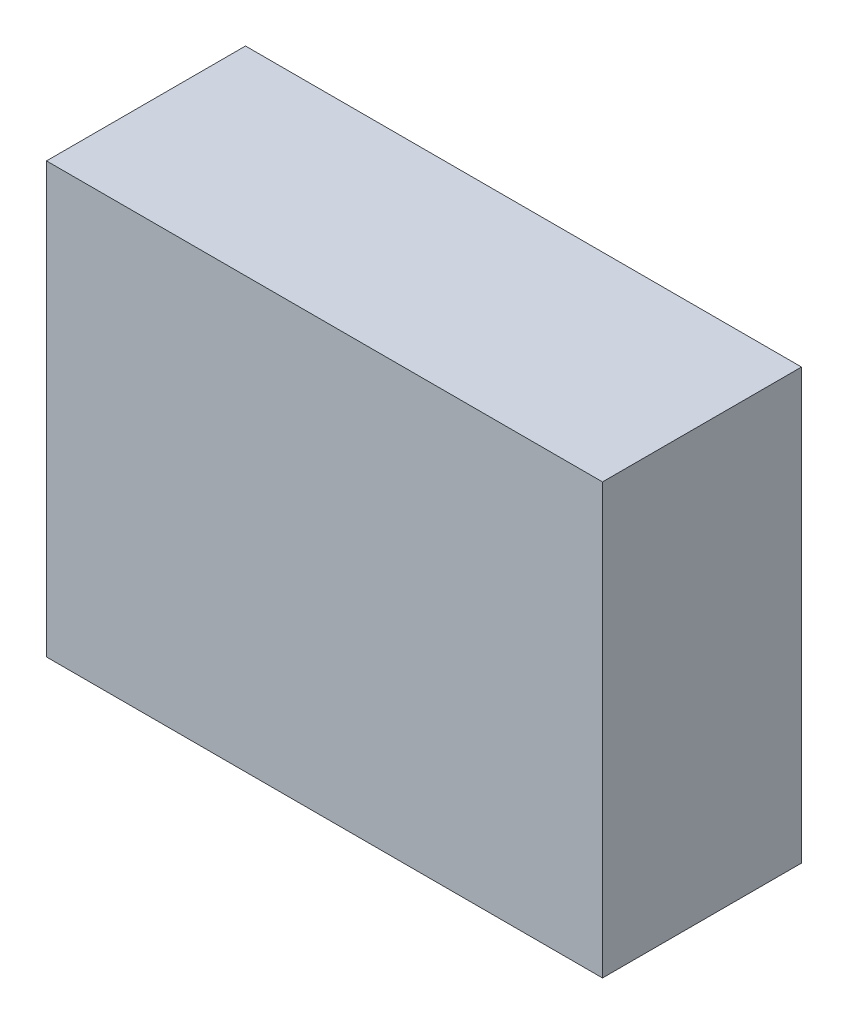
ISO-10303-21;
HEADER;
FILE_DESCRIPTION(('STEP AP214'),'2;1');
FILE_NAME('part.step','',(''),(''),'','','');
FILE_SCHEMA(('AUTOMOTIVE_DESIGN { 1 0 10303 214 1 1 1 1 }'));
ENDSEC;
DATA;
#1=APPLICATION_CONTEXT('core data for automotive mechanical design processes');
#2=APPLICATION_PROTOCOL_DEFINITION('international standard','automotive_design',2000,#1);
#3=PRODUCT_CONTEXT('',#1,'mechanical');
#4=PRODUCT('Part','Part','',(#3));
#5=PRODUCT_RELATED_PRODUCT_CATEGORY('part','',(#4));
#6=PRODUCT_DEFINITION_FORMATION('','',#4);
#7=PRODUCT_DEFINITION_CONTEXT('part definition',#1,'design');
#8=PRODUCT_DEFINITION('design','',#6,#7);
#9=PRODUCT_DEFINITION_SHAPE('','',#8);
#10=(LENGTH_UNIT() NAMED_UNIT(*) SI_UNIT(.MILLI.,.METRE.));
#11=(NAMED_UNIT(*) PLANE_ANGLE_UNIT() SI_UNIT($,.RADIAN.));
#12=(NAMED_UNIT(*) SI_UNIT($,.STERADIAN.) SOLID_ANGLE_UNIT());
#13=UNCERTAINTY_MEASURE_WITH_UNIT(LENGTH_MEASURE(1.E-05),#10,'distance_accuracy_value','');
#14=(GEOMETRIC_REPRESENTATION_CONTEXT(3) GLOBAL_UNCERTAINTY_ASSIGNED_CONTEXT((#13)) GLOBAL_UNIT_ASSIGNED_CONTEXT((#10,
#11,#12)) REPRESENTATION_CONTEXT('',''));
#15=CARTESIAN_POINT('',(0.,0.,0.));
#16=DIRECTION('',(0.,0.,1.));
#17=DIRECTION('',(1.,0.,0.));
#18=AXIS2_PLACEMENT_3D('',#15,#16,#17);
#19=CARTESIAN_POINT('',(0.,0.,0.1999996));
#20=DIRECTION('',(0.,0.,1.));
#21=DIRECTION('',(1.,0.,0.));
#22=AXIS2_PLACEMENT_3D('',#19,#20,#21);
#23=PLANE('',#22);
#24=DIRECTION('',(0.,1.,0.));
#25=VECTOR('',#24,1.);
#26=CARTESIAN_POINT('',(0.2794,-0.2159,0.1999996));
#27=LINE('',#26,#25);
#28=CARTESIAN_POINT('',(0.2794,-0.2159,0.1999996));
#29=VERTEX_POINT('',#28);
#30=CARTESIAN_POINT('',(0.2794,0.2159,0.1999996));
#31=VERTEX_POINT('',#30);
#32=EDGE_CURVE('E92',#29,#31,#27,.T.);
#33=ORIENTED_EDGE('',*,*,#32,.T.);
#34=DIRECTION('',(-1.,0.,0.));
#35=VECTOR('',#34,1.);
#36=CARTESIAN_POINT('',(0.2794,0.2159,0.1999996));
#37=LINE('',#36,#35);
#38=CARTESIAN_POINT('',(-0.2794,0.2159,0.1999996));
#39=VERTEX_POINT('',#38);
#40=EDGE_CURVE('E75',#31,#39,#37,.T.);
#41=ORIENTED_EDGE('',*,*,#40,.T.);
#42=DIRECTION('',(0.,-1.,0.));
#43=VECTOR('',#42,1.);
#44=CARTESIAN_POINT('',(-0.2794,0.2159,0.1999996));
#45=LINE('',#44,#43);
#46=CARTESIAN_POINT('',(-0.2794,-0.2159,0.1999996));
#47=VERTEX_POINT('',#46);
#48=EDGE_CURVE('E86',#39,#47,#45,.T.);
#49=ORIENTED_EDGE('',*,*,#48,.T.);
#50=DIRECTION('',(1.,0.,0.));
#51=VECTOR('',#50,1.);
#52=CARTESIAN_POINT('',(-0.2794,-0.2159,0.1999996));
#53=LINE('',#52,#51);
#54=EDGE_CURVE('E11',#47,#29,#53,.T.);
#55=ORIENTED_EDGE('',*,*,#54,.T.);
#56=EDGE_LOOP('',(#33,#41,#49,#55));
#57=FACE_BOUND('',#56,.T.);
#58=ADVANCED_FACE('F17',(#57),#23,.T.);
#59=CARTESIAN_POINT('',(0.,0.,0.));
#60=DIRECTION('',(0.,0.,1.));
#61=DIRECTION('',(1.,0.,0.));
#62=AXIS2_PLACEMENT_3D('',#59,#60,#61);
#63=PLANE('',#62);
#64=DIRECTION('',(1.,0.,0.));
#65=VECTOR('',#64,1.);
#66=CARTESIAN_POINT('',(-0.2794,-0.2159,0.));
#67=LINE('',#66,#65);
#68=CARTESIAN_POINT('',(-0.2794,-0.2159,0.));
#69=VERTEX_POINT('',#68);
#70=CARTESIAN_POINT('',(0.2794,-0.2159,0.));
#71=VERTEX_POINT('',#70);
#72=EDGE_CURVE('E20',#69,#71,#67,.T.);
#73=ORIENTED_EDGE('',*,*,#72,.F.);
#74=DIRECTION('',(0.,-1.,0.));
#75=VECTOR('',#74,1.);
#76=CARTESIAN_POINT('',(-0.2794,0.2159,0.));
#77=LINE('',#76,#75);
#78=CARTESIAN_POINT('',(-0.2794,0.2159,0.));
#79=VERTEX_POINT('',#78);
#80=EDGE_CURVE('E58',#79,#69,#77,.T.);
#81=ORIENTED_EDGE('',*,*,#80,.F.);
#82=DIRECTION('',(-1.,0.,0.));
#83=VECTOR('',#82,1.);
#84=CARTESIAN_POINT('',(0.2794,0.2159,0.));
#85=LINE('',#84,#83);
#86=CARTESIAN_POINT('',(0.2794,0.2159,0.));
#87=VERTEX_POINT('',#86);
#88=EDGE_CURVE('E94',#87,#79,#85,.T.);
#89=ORIENTED_EDGE('',*,*,#88,.F.);
#90=DIRECTION('',(0.,1.,0.));
#91=VECTOR('',#90,1.);
#92=CARTESIAN_POINT('',(0.2794,-0.2159,0.));
#93=LINE('',#92,#91);
#94=EDGE_CURVE('E91',#71,#87,#93,.T.);
#95=ORIENTED_EDGE('',*,*,#94,.F.);
#96=EDGE_LOOP('',(#73,#81,#89,#95));
#97=FACE_BOUND('',#96,.T.);
#98=ADVANCED_FACE('F96',(#97),#63,.F.);
#99=CARTESIAN_POINT('',(-0.2794,-0.2159,0.));
#100=DIRECTION('',(0.,1.,0.));
#101=DIRECTION('',(1.,0.,0.));
#102=AXIS2_PLACEMENT_3D('',#99,#100,#101);
#103=PLANE('',#102);
#104=ORIENTED_EDGE('',*,*,#72,.T.);
#105=DIRECTION('',(0.,0.,1.));
#106=VECTOR('',#105,1.);
#107=CARTESIAN_POINT('',(0.2794,-0.2159,0.));
#108=LINE('',#107,#106);
#109=EDGE_CURVE('E81',#71,#29,#108,.T.);
#110=ORIENTED_EDGE('',*,*,#109,.T.);
#111=ORIENTED_EDGE('',*,*,#54,.F.);
#112=DIRECTION('',(0.,0.,1.));
#113=VECTOR('',#112,1.);
#114=CARTESIAN_POINT('',(-0.2794,-0.2159,0.));
#115=LINE('',#114,#113);
#116=EDGE_CURVE('E84',#69,#47,#115,.T.);
#117=ORIENTED_EDGE('',*,*,#116,.F.);
#118=EDGE_LOOP('',(#104,#110,#111,#117));
#119=FACE_BOUND('',#118,.T.);
#120=ADVANCED_FACE('F80',(#119),#103,.F.);
#121=CARTESIAN_POINT('',(-0.2794,0.2159,0.));
#122=DIRECTION('',(1.,0.,0.));
#123=DIRECTION('',(0.,1.,0.));
#124=AXIS2_PLACEMENT_3D('',#121,#122,#123);
#125=PLANE('',#124);
#126=ORIENTED_EDGE('',*,*,#80,.T.);
#127=ORIENTED_EDGE('',*,*,#116,.T.);
#128=ORIENTED_EDGE('',*,*,#48,.F.);
#129=DIRECTION('',(0.,0.,1.));
#130=VECTOR('',#129,1.);
#131=CARTESIAN_POINT('',(-0.2794,0.2159,0.));
#132=LINE('',#131,#130);
#133=EDGE_CURVE('E110',#79,#39,#132,.T.);
#134=ORIENTED_EDGE('',*,*,#133,.F.);
#135=EDGE_LOOP('',(#126,#127,#128,#134));
#136=FACE_BOUND('',#135,.T.);
#137=ADVANCED_FACE('F122',(#136),#125,.F.);
#138=CARTESIAN_POINT('',(0.2794,0.2159,0.));
#139=DIRECTION('',(0.,-1.,0.));
#140=DIRECTION('',(0.,0.,-1.));
#141=AXIS2_PLACEMENT_3D('',#138,#139,#140);
#142=PLANE('',#141);
#143=ORIENTED_EDGE('',*,*,#88,.T.);
#144=ORIENTED_EDGE('',*,*,#133,.T.);
#145=ORIENTED_EDGE('',*,*,#40,.F.);
#146=DIRECTION('',(0.,0.,1.));
#147=VECTOR('',#146,1.);
#148=CARTESIAN_POINT('',(0.2794,0.2159,0.));
#149=LINE('',#148,#147);
#150=EDGE_CURVE('E99',#87,#31,#149,.T.);
#151=ORIENTED_EDGE('',*,*,#150,.F.);
#152=EDGE_LOOP('',(#143,#144,#145,#151));
#153=FACE_BOUND('',#152,.T.);
#154=ADVANCED_FACE('F166',(#153),#142,.F.);
#155=CARTESIAN_POINT('',(0.2794,-0.2159,0.));
#156=DIRECTION('',(-1.,0.,0.));
#157=DIRECTION('',(0.,0.,1.));
#158=AXIS2_PLACEMENT_3D('',#155,#156,#157);
#159=PLANE('',#158);
#160=ORIENTED_EDGE('',*,*,#94,.T.);
#161=ORIENTED_EDGE('',*,*,#150,.T.);
#162=ORIENTED_EDGE('',*,*,#32,.F.);
#163=ORIENTED_EDGE('',*,*,#109,.F.);
#164=EDGE_LOOP('',(#160,#161,#162,#163));
#165=FACE_BOUND('',#164,.T.);
#166=ADVANCED_FACE('F89',(#165),#159,.F.);
#167=CLOSED_SHELL('',(#58,#98,#120,#137,#154,#166));
#168=MANIFOLD_SOLID_BREP('B1',#167);
#169=ADVANCED_BREP_SHAPE_REPRESENTATION('',(#18,#168),#14);
#170=SHAPE_DEFINITION_REPRESENTATION(#9,#169);
ENDSEC;
END-ISO-10303-21;
